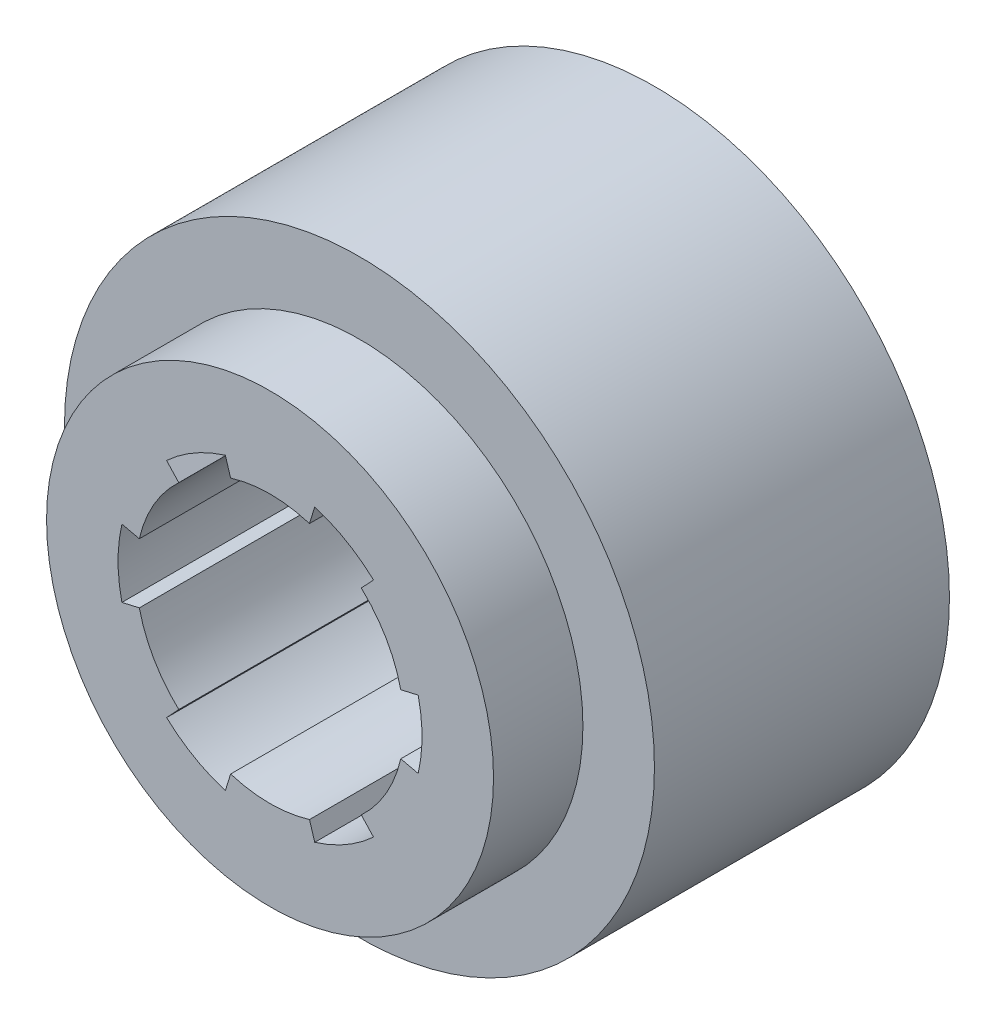
ISO-10303-21;
HEADER;
FILE_DESCRIPTION(('STEP AP214'),'2;1');
FILE_NAME('part.step','',(''),(''),'','','');
FILE_SCHEMA(('AUTOMOTIVE_DESIGN { 1 0 10303 214 1 1 1 1 }'));
ENDSEC;
DATA;
#1=APPLICATION_CONTEXT('core data for automotive mechanical design processes');
#2=APPLICATION_PROTOCOL_DEFINITION('international standard','automotive_design',2000,#1);
#3=PRODUCT_CONTEXT('',#1,'mechanical');
#4=PRODUCT('Part','Part','',(#3));
#5=PRODUCT_RELATED_PRODUCT_CATEGORY('part','',(#4));
#6=PRODUCT_DEFINITION_FORMATION('','',#4);
#7=PRODUCT_DEFINITION_CONTEXT('part definition',#1,'design');
#8=PRODUCT_DEFINITION('design','',#6,#7);
#9=PRODUCT_DEFINITION_SHAPE('','',#8);
#10=(LENGTH_UNIT() NAMED_UNIT(*) SI_UNIT(.MILLI.,.METRE.));
#11=(NAMED_UNIT(*) PLANE_ANGLE_UNIT() SI_UNIT($,.RADIAN.));
#12=(NAMED_UNIT(*) SI_UNIT($,.STERADIAN.) SOLID_ANGLE_UNIT());
#13=UNCERTAINTY_MEASURE_WITH_UNIT(LENGTH_MEASURE(1.E-05),#10,'distance_accuracy_value','');
#14=(GEOMETRIC_REPRESENTATION_CONTEXT(3) GLOBAL_UNCERTAINTY_ASSIGNED_CONTEXT((#13)) GLOBAL_UNIT_ASSIGNED_CONTEXT((#10,
#11,#12)) REPRESENTATION_CONTEXT('',''));
#15=CARTESIAN_POINT('',(0.,0.,0.));
#16=DIRECTION('',(0.,0.,1.));
#17=DIRECTION('',(1.,0.,0.));
#18=AXIS2_PLACEMENT_3D('',#15,#16,#17);
#19=CARTESIAN_POINT('',(0.,0.,5.));
#20=DIRECTION('',(0.,0.,1.));
#21=DIRECTION('',(1.,0.,0.));
#22=AXIS2_PLACEMENT_3D('',#19,#20,#21);
#23=PLANE('',#22);
#24=CARTESIAN_POINT('',(0.,0.,5.));
#25=DIRECTION('',(0.,0.,1.));
#26=DIRECTION('',(1.,0.,0.));
#27=AXIS2_PLACEMENT_3D('',#24,#25,#26);
#28=CIRCLE('',#27,25.);
#29=CARTESIAN_POINT('',(25.,0.,5.));
#30=VERTEX_POINT('',#29);
#31=EDGE_CURVE('E11',#30,#30,#28,.T.);
#32=ORIENTED_EDGE('',*,*,#31,.T.);
#33=EDGE_LOOP('',(#32));
#34=FACE_BOUND('',#33,.T.);
#35=DIRECTION('',(0.680661604674729,-0.73259796609165,0.));
#36=VECTOR('',#35,1.);
#37=CARTESIAN_POINT('',(-11.5712472794703,12.4541654235581,5.));
#38=LINE('',#37,#36);
#39=CARTESIAN_POINT('',(-11.5712472794703,12.4541654235581,5.));
#40=VERTEX_POINT('',#39);
#41=CARTESIAN_POINT('',(-10.2099240701208,10.9889694913748,5.));
#42=VERTEX_POINT('',#41);
#43=EDGE_CURVE('E292',#40,#42,#38,.T.);
#44=ORIENTED_EDGE('',*,*,#43,.F.);
#45=CARTESIAN_POINT('',(0.,0.,5.));
#46=DIRECTION('',(0.,0.,1.));
#47=DIRECTION('',(1.,0.,0.));
#48=AXIS2_PLACEMENT_3D('',#45,#46,#47);
#49=CIRCLE('',#48,17.);
#50=CARTESIAN_POINT('',(-5.,16.2480768092719,5.));
#51=VERTEX_POINT('',#50);
#52=EDGE_CURVE('E290',#51,#40,#49,.T.);
#53=ORIENTED_EDGE('',*,*,#52,.F.);
#54=DIRECTION('',(-0.294117647058829,0.955769224074817,0.));
#55=VECTOR('',#54,1.);
#56=CARTESIAN_POINT('',(-5.,16.2480768092719,5.));
#57=LINE('',#56,#55);
#58=CARTESIAN_POINT('',(-4.41176470588234,14.3365383611223,5.));
#59=VERTEX_POINT('',#58);
#60=EDGE_CURVE('E54',#59,#51,#57,.T.);
#61=ORIENTED_EDGE('',*,*,#60,.F.);
#62=CARTESIAN_POINT('',(0.,0.,5.));
#63=DIRECTION('',(0.,0.,1.));
#64=DIRECTION('',(1.,0.,0.));
#65=AXIS2_PLACEMENT_3D('',#62,#63,#64);
#66=CIRCLE('',#65,15.);
#67=CARTESIAN_POINT('',(4.41176470588237,14.3365383611223,5.));
#68=VERTEX_POINT('',#67);
#69=EDGE_CURVE('E333',#68,#59,#66,.T.);
#70=ORIENTED_EDGE('',*,*,#69,.F.);
#71=DIRECTION('',(-0.294117647058815,-0.955769224074822,0.));
#72=VECTOR('',#71,1.);
#73=CARTESIAN_POINT('',(5.,16.2480768092719,5.));
#74=LINE('',#73,#72);
#75=CARTESIAN_POINT('',(5.,16.2480768092719,5.));
#76=VERTEX_POINT('',#75);
#77=EDGE_CURVE('E331',#76,#68,#74,.T.);
#78=ORIENTED_EDGE('',*,*,#77,.F.);
#79=CARTESIAN_POINT('',(0.,0.,5.));
#80=DIRECTION('',(0.,0.,1.));
#81=DIRECTION('',(1.,0.,0.));
#82=AXIS2_PLACEMENT_3D('',#79,#80,#81);
#83=CIRCLE('',#82,17.);
#84=CARTESIAN_POINT('',(11.5712472794703,12.4541654235582,5.));
#85=VERTEX_POINT('',#84);
#86=EDGE_CURVE('E329',#85,#76,#83,.T.);
#87=ORIENTED_EDGE('',*,*,#86,.F.);
#88=DIRECTION('',(0.680661604674719,0.73259796609166,0.));
#89=VECTOR('',#88,1.);
#90=CARTESIAN_POINT('',(11.5712472794703,12.4541654235582,5.));
#91=LINE('',#90,#89);
#92=CARTESIAN_POINT('',(10.2099240701209,10.9889694913748,5.));
#93=VERTEX_POINT('',#92);
#94=EDGE_CURVE('E202',#93,#85,#91,.T.);
#95=ORIENTED_EDGE('',*,*,#94,.F.);
#96=CARTESIAN_POINT('',(0.,0.,5.));
#97=DIRECTION('',(0.,0.,1.));
#98=DIRECTION('',(1.,0.,0.));
#99=AXIS2_PLACEMENT_3D('',#96,#97,#98);
#100=CIRCLE('',#99,15.);
#101=CARTESIAN_POINT('',(14.6216887760032,3.34756886974743,5.));
#102=VERTEX_POINT('',#101);
#103=EDGE_CURVE('E326',#102,#93,#100,.T.);
#104=ORIENTED_EDGE('',*,*,#103,.F.);
#105=DIRECTION('',(-0.974779251733544,-0.223171257983171,0.));
#106=VECTOR('',#105,1.);
#107=CARTESIAN_POINT('',(16.5712472794703,3.79391138571377,5.));
#108=LINE('',#107,#106);
#109=CARTESIAN_POINT('',(16.5712472794703,3.79391138571377,5.));
#110=VERTEX_POINT('',#109);
#111=EDGE_CURVE('E324',#110,#102,#108,.T.);
#112=ORIENTED_EDGE('',*,*,#111,.F.);
#113=CARTESIAN_POINT('',(0.,0.,5.));
#114=DIRECTION('',(0.,0.,1.));
#115=DIRECTION('',(1.,0.,0.));
#116=AXIS2_PLACEMENT_3D('',#113,#114,#115);
#117=CIRCLE('',#116,17.);
#118=CARTESIAN_POINT('',(16.5712472794703,-3.79391138571377,5.));
#119=VERTEX_POINT('',#118);
#120=EDGE_CURVE('E322',#119,#110,#117,.T.);
#121=ORIENTED_EDGE('',*,*,#120,.F.);
#122=DIRECTION('',(0.974779251733548,-0.223171257983157,0.));
#123=VECTOR('',#122,1.);
#124=CARTESIAN_POINT('',(16.5712472794703,-3.79391138571376,5.));
#125=LINE('',#124,#123);
#126=CARTESIAN_POINT('',(14.6216887760032,-3.34756886974745,5.));
#127=VERTEX_POINT('',#126);
#128=EDGE_CURVE('E320',#127,#119,#125,.T.);
#129=ORIENTED_EDGE('',*,*,#128,.F.);
#130=CARTESIAN_POINT('',(0.,0.,5.));
#131=DIRECTION('',(0.,0.,1.));
#132=DIRECTION('',(1.,0.,0.));
#133=AXIS2_PLACEMENT_3D('',#130,#131,#132);
#134=CIRCLE('',#133,15.);
#135=CARTESIAN_POINT('',(10.2099240701208,-10.9889694913749,5.));
#136=VERTEX_POINT('',#135);
#137=EDGE_CURVE('E318',#136,#127,#134,.T.);
#138=ORIENTED_EDGE('',*,*,#137,.F.);
#139=DIRECTION('',(-0.68066160467473,0.732597966091649,0.));
#140=VECTOR('',#139,1.);
#141=CARTESIAN_POINT('',(11.5712472794703,-12.4541654235582,5.));
#142=LINE('',#141,#140);
#143=CARTESIAN_POINT('',(11.5712472794703,-12.4541654235582,5.));
#144=VERTEX_POINT('',#143);
#145=EDGE_CURVE('E316',#144,#136,#142,.T.);
#146=ORIENTED_EDGE('',*,*,#145,.F.);
#147=CARTESIAN_POINT('',(0.,0.,5.));
#148=DIRECTION('',(0.,0.,1.));
#149=DIRECTION('',(1.,0.,0.));
#150=AXIS2_PLACEMENT_3D('',#147,#148,#149);
#151=CIRCLE('',#150,17.);
#152=CARTESIAN_POINT('',(5.,-16.2480768092719,5.));
#153=VERTEX_POINT('',#152);
#154=EDGE_CURVE('E314',#153,#144,#151,.T.);
#155=ORIENTED_EDGE('',*,*,#154,.F.);
#156=DIRECTION('',(0.294117647058829,-0.955769224074817,0.));
#157=VECTOR('',#156,1.);
#158=CARTESIAN_POINT('',(5.,-16.2480768092719,5.));
#159=LINE('',#158,#157);
#160=CARTESIAN_POINT('',(4.41176470588234,-14.3365383611223,5.));
#161=VERTEX_POINT('',#160);
#162=EDGE_CURVE('E312',#161,#153,#159,.T.);
#163=ORIENTED_EDGE('',*,*,#162,.F.);
#164=CARTESIAN_POINT('',(0.,0.,5.));
#165=DIRECTION('',(0.,0.,1.));
#166=DIRECTION('',(1.,0.,0.));
#167=AXIS2_PLACEMENT_3D('',#164,#165,#166);
#168=CIRCLE('',#167,15.);
#169=CARTESIAN_POINT('',(-4.41176470588237,-14.3365383611223,5.));
#170=VERTEX_POINT('',#169);
#171=EDGE_CURVE('E310',#170,#161,#168,.T.);
#172=ORIENTED_EDGE('',*,*,#171,.F.);
#173=DIRECTION('',(0.294117647058815,0.955769224074822,0.));
#174=VECTOR('',#173,1.);
#175=CARTESIAN_POINT('',(-5.,-16.2480768092719,5.));
#176=LINE('',#175,#174);
#177=CARTESIAN_POINT('',(-5.,-16.2480768092719,5.));
#178=VERTEX_POINT('',#177);
#179=EDGE_CURVE('E308',#178,#170,#176,.T.);
#180=ORIENTED_EDGE('',*,*,#179,.F.);
#181=CARTESIAN_POINT('',(0.,0.,5.));
#182=DIRECTION('',(0.,0.,1.));
#183=DIRECTION('',(1.,0.,0.));
#184=AXIS2_PLACEMENT_3D('',#181,#182,#183);
#185=CIRCLE('',#184,17.);
#186=CARTESIAN_POINT('',(-11.5712472794703,-12.4541654235582,5.));
#187=VERTEX_POINT('',#186);
#188=EDGE_CURVE('E306',#187,#178,#185,.T.);
#189=ORIENTED_EDGE('',*,*,#188,.F.);
#190=DIRECTION('',(-0.680661604674719,-0.73259796609166,0.));
#191=VECTOR('',#190,1.);
#192=CARTESIAN_POINT('',(-11.5712472794703,-12.4541654235582,5.));
#193=LINE('',#192,#191);
#194=CARTESIAN_POINT('',(-10.2099240701208,-10.9889694913748,5.));
#195=VERTEX_POINT('',#194);
#196=EDGE_CURVE('E304',#195,#187,#193,.T.);
#197=ORIENTED_EDGE('',*,*,#196,.F.);
#198=CARTESIAN_POINT('',(0.,0.,5.));
#199=DIRECTION('',(0.,0.,1.));
#200=DIRECTION('',(1.,0.,0.));
#201=AXIS2_PLACEMENT_3D('',#198,#199,#200);
#202=CIRCLE('',#201,15.);
#203=CARTESIAN_POINT('',(-14.6216887760032,-3.34756886974743,5.));
#204=VERTEX_POINT('',#203);
#205=EDGE_CURVE('E302',#204,#195,#202,.T.);
#206=ORIENTED_EDGE('',*,*,#205,.F.);
#207=DIRECTION('',(0.974779251733544,0.223171257983172,0.));
#208=VECTOR('',#207,1.);
#209=CARTESIAN_POINT('',(-16.5712472794703,-3.79391138571378,5.));
#210=LINE('',#209,#208);
#211=CARTESIAN_POINT('',(-16.5712472794703,-3.79391138571378,5.));
#212=VERTEX_POINT('',#211);
#213=EDGE_CURVE('E300',#212,#204,#210,.T.);
#214=ORIENTED_EDGE('',*,*,#213,.F.);
#215=CARTESIAN_POINT('',(0.,0.,5.));
#216=DIRECTION('',(0.,0.,1.));
#217=DIRECTION('',(1.,0.,0.));
#218=AXIS2_PLACEMENT_3D('',#215,#216,#217);
#219=CIRCLE('',#218,17.);
#220=CARTESIAN_POINT('',(-16.5712472794703,3.79391138571375,5.));
#221=VERTEX_POINT('',#220);
#222=EDGE_CURVE('E298',#221,#212,#219,.T.);
#223=ORIENTED_EDGE('',*,*,#222,.F.);
#224=DIRECTION('',(-0.974779251733548,0.223171257983156,0.));
#225=VECTOR('',#224,1.);
#226=CARTESIAN_POINT('',(-16.5712472794703,3.79391138571375,5.));
#227=LINE('',#226,#225);
#228=CARTESIAN_POINT('',(-14.6216887760032,3.34756886974744,5.));
#229=VERTEX_POINT('',#228);
#230=EDGE_CURVE('E296',#229,#221,#227,.T.);
#231=ORIENTED_EDGE('',*,*,#230,.F.);
#232=CARTESIAN_POINT('',(0.,0.,5.));
#233=DIRECTION('',(0.,0.,1.));
#234=DIRECTION('',(1.,0.,0.));
#235=AXIS2_PLACEMENT_3D('',#232,#233,#234);
#236=CIRCLE('',#235,15.);
#237=EDGE_CURVE('E294',#42,#229,#236,.T.);
#238=ORIENTED_EDGE('',*,*,#237,.F.);
#239=EDGE_LOOP('',(#44,#53,#61,#70,#78,#87,#95,#104,#112,#121,#129,#138,#146,#155,#163,#172,
#180,#189,#197,#206,#214,#223,#231,#238));
#240=FACE_BOUND('',#239,.T.);
#241=ADVANCED_FACE('F33',(#34,#240),#23,.T.);
#242=CARTESIAN_POINT('',(0.,0.,5.));
#243=DIRECTION('',(0.,0.,-1.));
#244=DIRECTION('',(-1.,0.,0.));
#245=AXIS2_PLACEMENT_3D('',#242,#243,#244);
#246=CYLINDRICAL_SURFACE('',#245,25.);
#247=ORIENTED_EDGE('',*,*,#31,.F.);
#248=EDGE_LOOP('',(#247));
#249=FACE_BOUND('',#248,.T.);
#250=CARTESIAN_POINT('',(0.,0.,-5.));
#251=DIRECTION('',(0.,0.,1.));
#252=DIRECTION('',(1.,0.,0.));
#253=AXIS2_PLACEMENT_3D('',#250,#251,#252);
#254=CIRCLE('',#253,25.);
#255=CARTESIAN_POINT('',(25.,0.,-5.));
#256=VERTEX_POINT('',#255);
#257=EDGE_CURVE('E37',#256,#256,#254,.T.);
#258=ORIENTED_EDGE('',*,*,#257,.T.);
#259=EDGE_LOOP('',(#258));
#260=FACE_BOUND('',#259,.T.);
#261=ADVANCED_FACE('F35',(#249,#260),#246,.T.);
#262=CARTESIAN_POINT('',(0.,0.,5.));
#263=DIRECTION('',(0.,0.,-1.));
#264=DIRECTION('',(-1.,0.,0.));
#265=AXIS2_PLACEMENT_3D('',#262,#263,#264);
#266=CYLINDRICAL_SURFACE('',#265,17.);
#267=DIRECTION('',(0.,0.,-1.));
#268=VECTOR('',#267,1.);
#269=CARTESIAN_POINT('',(-11.5712472794703,12.4541654235581,5.));
#270=LINE('',#269,#268);
#271=CARTESIAN_POINT('',(-11.5712472794703,12.4541654235581,-38.));
#272=VERTEX_POINT('',#271);
#273=EDGE_CURVE('E42',#40,#272,#270,.T.);
#274=ORIENTED_EDGE('',*,*,#273,.T.);
#275=CARTESIAN_POINT('',(0.,0.,-38.));
#276=DIRECTION('',(0.,0.,-1.));
#277=DIRECTION('',(-1.,0.,0.));
#278=AXIS2_PLACEMENT_3D('',#275,#276,#277);
#279=CIRCLE('',#278,17.);
#280=CARTESIAN_POINT('',(-5.,16.2480768092719,-38.));
#281=VERTEX_POINT('',#280);
#282=EDGE_CURVE('E274',#272,#281,#279,.T.);
#283=ORIENTED_EDGE('',*,*,#282,.T.);
#284=DIRECTION('',(0.,0.,-1.));
#285=VECTOR('',#284,1.);
#286=CARTESIAN_POINT('',(-5.,16.2480768092719,5.));
#287=LINE('',#286,#285);
#288=EDGE_CURVE('E336',#51,#281,#287,.T.);
#289=ORIENTED_EDGE('',*,*,#288,.F.);
#290=ORIENTED_EDGE('',*,*,#52,.T.);
#291=EDGE_LOOP('',(#274,#283,#289,#290));
#292=FACE_BOUND('',#291,.T.);
#293=ADVANCED_FACE('F379',(#292),#266,.F.);
#294=CARTESIAN_POINT('',(-11.5712472794703,12.4541654235581,5.));
#295=DIRECTION('',(0.73259796609165,0.680661604674729,0.));
#296=DIRECTION('',(-0.680661604674729,0.73259796609165,0.));
#297=AXIS2_PLACEMENT_3D('',#294,#295,#296);
#298=PLANE('',#297);
#299=DIRECTION('',(0.,0.,-1.));
#300=VECTOR('',#299,1.);
#301=CARTESIAN_POINT('',(-10.2099240701208,10.9889694913748,5.));
#302=LINE('',#301,#300);
#303=CARTESIAN_POINT('',(-10.2099240701208,10.9889694913748,-38.));
#304=VERTEX_POINT('',#303);
#305=EDGE_CURVE('E375',#42,#304,#302,.T.);
#306=ORIENTED_EDGE('',*,*,#305,.T.);
#307=DIRECTION('',(-0.680661604674728,0.732597966091651,0.));
#308=VECTOR('',#307,1.);
#309=CARTESIAN_POINT('',(-11.5712472794703,12.4541654235581,-38.));
#310=LINE('',#309,#308);
#311=EDGE_CURVE('E271',#304,#272,#310,.T.);
#312=ORIENTED_EDGE('',*,*,#311,.T.);
#313=ORIENTED_EDGE('',*,*,#273,.F.);
#314=ORIENTED_EDGE('',*,*,#43,.T.);
#315=EDGE_LOOP('',(#306,#312,#313,#314));
#316=FACE_BOUND('',#315,.T.);
#317=ADVANCED_FACE('F386',(#316),#298,.T.);
#318=CARTESIAN_POINT('',(0.,0.,5.));
#319=DIRECTION('',(0.,0.,-1.));
#320=DIRECTION('',(-1.,0.,0.));
#321=AXIS2_PLACEMENT_3D('',#318,#319,#320);
#322=CYLINDRICAL_SURFACE('',#321,15.);
#323=DIRECTION('',(0.,0.,-1.));
#324=VECTOR('',#323,1.);
#325=CARTESIAN_POINT('',(-14.6216887760032,3.34756886974744,5.));
#326=LINE('',#325,#324);
#327=CARTESIAN_POINT('',(-14.6216887760032,3.34756886974744,-38.));
#328=VERTEX_POINT('',#327);
#329=EDGE_CURVE('E373',#229,#328,#326,.T.);
#330=ORIENTED_EDGE('',*,*,#329,.T.);
#331=CARTESIAN_POINT('',(0.,0.,-38.));
#332=DIRECTION('',(0.,0.,-1.));
#333=DIRECTION('',(-1.,0.,0.));
#334=AXIS2_PLACEMENT_3D('',#331,#332,#333);
#335=CIRCLE('',#334,15.);
#336=EDGE_CURVE('E268',#328,#304,#335,.T.);
#337=ORIENTED_EDGE('',*,*,#336,.T.);
#338=ORIENTED_EDGE('',*,*,#305,.F.);
#339=ORIENTED_EDGE('',*,*,#237,.T.);
#340=EDGE_LOOP('',(#330,#337,#338,#339));
#341=FACE_BOUND('',#340,.T.);
#342=ADVANCED_FACE('F396',(#341),#322,.F.);
#343=CARTESIAN_POINT('',(-16.5712472794703,3.79391138571375,5.));
#344=DIRECTION('',(-0.223171257983156,-0.974779251733548,0.));
#345=DIRECTION('',(0.974779251733548,-0.223171257983156,0.));
#346=AXIS2_PLACEMENT_3D('',#343,#344,#345);
#347=PLANE('',#346);
#348=DIRECTION('',(0.,0.,-1.));
#349=VECTOR('',#348,1.);
#350=CARTESIAN_POINT('',(-16.5712472794703,3.79391138571375,5.));
#351=LINE('',#350,#349);
#352=CARTESIAN_POINT('',(-16.5712472794703,3.79391138571375,-38.));
#353=VERTEX_POINT('',#352);
#354=EDGE_CURVE('E371',#221,#353,#351,.T.);
#355=ORIENTED_EDGE('',*,*,#354,.T.);
#356=DIRECTION('',(0.974779251733548,-0.223171257983155,0.));
#357=VECTOR('',#356,1.);
#358=CARTESIAN_POINT('',(-14.6216887760032,3.34756886974744,-38.));
#359=LINE('',#358,#357);
#360=EDGE_CURVE('E265',#353,#328,#359,.T.);
#361=ORIENTED_EDGE('',*,*,#360,.T.);
#362=ORIENTED_EDGE('',*,*,#329,.F.);
#363=ORIENTED_EDGE('',*,*,#230,.T.);
#364=EDGE_LOOP('',(#355,#361,#362,#363));
#365=FACE_BOUND('',#364,.T.);
#366=ADVANCED_FACE('F402',(#365),#347,.T.);
#367=CARTESIAN_POINT('',(0.,0.,5.));
#368=DIRECTION('',(0.,0.,-1.));
#369=DIRECTION('',(-1.,0.,0.));
#370=AXIS2_PLACEMENT_3D('',#367,#368,#369);
#371=CYLINDRICAL_SURFACE('',#370,17.);
#372=DIRECTION('',(0.,0.,-1.));
#373=VECTOR('',#372,1.);
#374=CARTESIAN_POINT('',(-16.5712472794703,-3.79391138571378,5.));
#375=LINE('',#374,#373);
#376=CARTESIAN_POINT('',(-16.5712472794703,-3.79391138571379,-38.));
#377=VERTEX_POINT('',#376);
#378=EDGE_CURVE('E369',#212,#377,#375,.T.);
#379=ORIENTED_EDGE('',*,*,#378,.T.);
#380=CARTESIAN_POINT('',(0.,0.,-38.));
#381=DIRECTION('',(0.,0.,-1.));
#382=DIRECTION('',(-1.,0.,0.));
#383=AXIS2_PLACEMENT_3D('',#380,#381,#382);
#384=CIRCLE('',#383,17.);
#385=EDGE_CURVE('E262',#377,#353,#384,.T.);
#386=ORIENTED_EDGE('',*,*,#385,.T.);
#387=ORIENTED_EDGE('',*,*,#354,.F.);
#388=ORIENTED_EDGE('',*,*,#222,.T.);
#389=EDGE_LOOP('',(#379,#386,#387,#388));
#390=FACE_BOUND('',#389,.T.);
#391=ADVANCED_FACE('F406',(#390),#371,.F.);
#392=CARTESIAN_POINT('',(-16.5712472794703,-3.79391138571378,5.));
#393=DIRECTION('',(-0.223171257983172,0.974779251733544,0.));
#394=DIRECTION('',(-0.974779251733544,-0.223171257983172,0.));
#395=AXIS2_PLACEMENT_3D('',#392,#393,#394);
#396=PLANE('',#395);
#397=DIRECTION('',(0.,0.,-1.));
#398=VECTOR('',#397,1.);
#399=CARTESIAN_POINT('',(-14.6216887760032,-3.34756886974743,5.));
#400=LINE('',#399,#398);
#401=CARTESIAN_POINT('',(-14.6216887760032,-3.34756886974743,-38.));
#402=VERTEX_POINT('',#401);
#403=EDGE_CURVE('E367',#204,#402,#400,.T.);
#404=ORIENTED_EDGE('',*,*,#403,.T.);
#405=DIRECTION('',(-0.974779251733544,-0.223171257983175,0.));
#406=VECTOR('',#405,1.);
#407=CARTESIAN_POINT('',(-16.5712472794703,-3.79391138571378,-38.));
#408=LINE('',#407,#406);
#409=EDGE_CURVE('E259',#402,#377,#408,.T.);
#410=ORIENTED_EDGE('',*,*,#409,.T.);
#411=ORIENTED_EDGE('',*,*,#378,.F.);
#412=ORIENTED_EDGE('',*,*,#213,.T.);
#413=EDGE_LOOP('',(#404,#410,#411,#412));
#414=FACE_BOUND('',#413,.T.);
#415=ADVANCED_FACE('F410',(#414),#396,.T.);
#416=CARTESIAN_POINT('',(0.,0.,5.));
#417=DIRECTION('',(0.,0.,-1.));
#418=DIRECTION('',(-1.,0.,0.));
#419=AXIS2_PLACEMENT_3D('',#416,#417,#418);
#420=CYLINDRICAL_SURFACE('',#419,15.);
#421=DIRECTION('',(0.,0.,-1.));
#422=VECTOR('',#421,1.);
#423=CARTESIAN_POINT('',(-10.2099240701208,-10.9889694913748,5.));
#424=LINE('',#423,#422);
#425=CARTESIAN_POINT('',(-10.2099240701208,-10.9889694913748,-38.));
#426=VERTEX_POINT('',#425);
#427=EDGE_CURVE('E365',#195,#426,#424,.T.);
#428=ORIENTED_EDGE('',*,*,#427,.T.);
#429=CARTESIAN_POINT('',(0.,0.,-38.));
#430=DIRECTION('',(0.,0.,-1.));
#431=DIRECTION('',(-1.,0.,0.));
#432=AXIS2_PLACEMENT_3D('',#429,#430,#431);
#433=CIRCLE('',#432,15.);
#434=EDGE_CURVE('E256',#426,#402,#433,.T.);
#435=ORIENTED_EDGE('',*,*,#434,.T.);
#436=ORIENTED_EDGE('',*,*,#403,.F.);
#437=ORIENTED_EDGE('',*,*,#205,.T.);
#438=EDGE_LOOP('',(#428,#435,#436,#437));
#439=FACE_BOUND('',#438,.T.);
#440=ADVANCED_FACE('F416',(#439),#420,.F.);
#441=CARTESIAN_POINT('',(-11.5712472794703,-12.4541654235582,5.));
#442=DIRECTION('',(0.73259796609166,-0.680661604674719,0.));
#443=DIRECTION('',(0.680661604674719,0.73259796609166,0.));
#444=AXIS2_PLACEMENT_3D('',#441,#442,#443);
#445=PLANE('',#444);
#446=DIRECTION('',(0.,0.,-1.));
#447=VECTOR('',#446,1.);
#448=CARTESIAN_POINT('',(-11.5712472794703,-12.4541654235582,5.));
#449=LINE('',#448,#447);
#450=CARTESIAN_POINT('',(-11.5712472794703,-12.4541654235582,-38.));
#451=VERTEX_POINT('',#450);
#452=EDGE_CURVE('E363',#187,#451,#449,.T.);
#453=ORIENTED_EDGE('',*,*,#452,.T.);
#454=DIRECTION('',(0.680661604674721,0.732597966091658,0.));
#455=VECTOR('',#454,1.);
#456=CARTESIAN_POINT('',(-10.2099240701208,-10.9889694913748,-38.));
#457=LINE('',#456,#455);
#458=EDGE_CURVE('E253',#451,#426,#457,.T.);
#459=ORIENTED_EDGE('',*,*,#458,.T.);
#460=ORIENTED_EDGE('',*,*,#427,.F.);
#461=ORIENTED_EDGE('',*,*,#196,.T.);
#462=EDGE_LOOP('',(#453,#459,#460,#461));
#463=FACE_BOUND('',#462,.T.);
#464=ADVANCED_FACE('F421',(#463),#445,.T.);
#465=CARTESIAN_POINT('',(0.,0.,5.));
#466=DIRECTION('',(0.,0.,-1.));
#467=DIRECTION('',(-1.,0.,0.));
#468=AXIS2_PLACEMENT_3D('',#465,#466,#467);
#469=CYLINDRICAL_SURFACE('',#468,17.);
#470=DIRECTION('',(0.,0.,-1.));
#471=VECTOR('',#470,1.);
#472=CARTESIAN_POINT('',(-5.,-16.2480768092719,5.));
#473=LINE('',#472,#471);
#474=CARTESIAN_POINT('',(-5.,-16.2480768092719,-38.));
#475=VERTEX_POINT('',#474);
#476=EDGE_CURVE('E361',#178,#475,#473,.T.);
#477=ORIENTED_EDGE('',*,*,#476,.T.);
#478=CARTESIAN_POINT('',(0.,0.,-38.));
#479=DIRECTION('',(0.,0.,-1.));
#480=DIRECTION('',(-1.,0.,0.));
#481=AXIS2_PLACEMENT_3D('',#478,#479,#480);
#482=CIRCLE('',#481,17.);
#483=EDGE_CURVE('E250',#475,#451,#482,.T.);
#484=ORIENTED_EDGE('',*,*,#483,.T.);
#485=ORIENTED_EDGE('',*,*,#452,.F.);
#486=ORIENTED_EDGE('',*,*,#188,.T.);
#487=EDGE_LOOP('',(#477,#484,#485,#486));
#488=FACE_BOUND('',#487,.T.);
#489=ADVANCED_FACE('F425',(#488),#469,.F.);
#490=CARTESIAN_POINT('',(-5.,-16.2480768092719,5.));
#491=DIRECTION('',(-0.955769224074822,0.294117647058815,0.));
#492=DIRECTION('',(-0.294117647058815,-0.955769224074822,0.));
#493=AXIS2_PLACEMENT_3D('',#490,#491,#492);
#494=PLANE('',#493);
#495=DIRECTION('',(0.,0.,-1.));
#496=VECTOR('',#495,1.);
#497=CARTESIAN_POINT('',(-4.41176470588237,-14.3365383611223,5.));
#498=LINE('',#497,#496);
#499=CARTESIAN_POINT('',(-4.41176470588237,-14.3365383611223,-38.));
#500=VERTEX_POINT('',#499);
#501=EDGE_CURVE('E359',#170,#500,#498,.T.);
#502=ORIENTED_EDGE('',*,*,#501,.T.);
#503=DIRECTION('',(-0.294117647058813,-0.955769224074822,0.));
#504=VECTOR('',#503,1.);
#505=CARTESIAN_POINT('',(-5.,-16.2480768092719,-38.));
#506=LINE('',#505,#504);
#507=EDGE_CURVE('E247',#500,#475,#506,.T.);
#508=ORIENTED_EDGE('',*,*,#507,.T.);
#509=ORIENTED_EDGE('',*,*,#476,.F.);
#510=ORIENTED_EDGE('',*,*,#179,.T.);
#511=EDGE_LOOP('',(#502,#508,#509,#510));
#512=FACE_BOUND('',#511,.T.);
#513=ADVANCED_FACE('F431',(#512),#494,.T.);
#514=CARTESIAN_POINT('',(0.,0.,5.));
#515=DIRECTION('',(0.,0.,-1.));
#516=DIRECTION('',(-1.,0.,0.));
#517=AXIS2_PLACEMENT_3D('',#514,#515,#516);
#518=CYLINDRICAL_SURFACE('',#517,15.);
#519=DIRECTION('',(0.,0.,-1.));
#520=VECTOR('',#519,1.);
#521=CARTESIAN_POINT('',(4.41176470588234,-14.3365383611223,5.));
#522=LINE('',#521,#520);
#523=CARTESIAN_POINT('',(4.41176470588235,-14.3365383611223,-38.));
#524=VERTEX_POINT('',#523);
#525=EDGE_CURVE('E357',#161,#524,#522,.T.);
#526=ORIENTED_EDGE('',*,*,#525,.T.);
#527=CARTESIAN_POINT('',(0.,0.,-38.));
#528=DIRECTION('',(0.,0.,-1.));
#529=DIRECTION('',(-1.,0.,0.));
#530=AXIS2_PLACEMENT_3D('',#527,#528,#529);
#531=CIRCLE('',#530,15.);
#532=EDGE_CURVE('E244',#524,#500,#531,.T.);
#533=ORIENTED_EDGE('',*,*,#532,.T.);
#534=ORIENTED_EDGE('',*,*,#501,.F.);
#535=ORIENTED_EDGE('',*,*,#171,.T.);
#536=EDGE_LOOP('',(#526,#533,#534,#535));
#537=FACE_BOUND('',#536,.T.);
#538=ADVANCED_FACE('F436',(#537),#518,.F.);
#539=CARTESIAN_POINT('',(5.,-16.2480768092719,5.));
#540=DIRECTION('',(0.955769224074817,0.294117647058829,0.));
#541=DIRECTION('',(-0.294117647058829,0.955769224074817,0.));
#542=AXIS2_PLACEMENT_3D('',#539,#540,#541);
#543=PLANE('',#542);
#544=DIRECTION('',(0.,0.,-1.));
#545=VECTOR('',#544,1.);
#546=CARTESIAN_POINT('',(5.,-16.2480768092719,5.));
#547=LINE('',#546,#545);
#548=CARTESIAN_POINT('',(5.,-16.2480768092719,-38.));
#549=VERTEX_POINT('',#548);
#550=EDGE_CURVE('E355',#153,#549,#547,.T.);
#551=ORIENTED_EDGE('',*,*,#550,.T.);
#552=DIRECTION('',(-0.29411764705883,0.955769224074817,0.));
#553=VECTOR('',#552,1.);
#554=CARTESIAN_POINT('',(4.41176470588234,-14.3365383611223,-38.));
#555=LINE('',#554,#553);
#556=EDGE_CURVE('E241',#549,#524,#555,.T.);
#557=ORIENTED_EDGE('',*,*,#556,.T.);
#558=ORIENTED_EDGE('',*,*,#525,.F.);
#559=ORIENTED_EDGE('',*,*,#162,.T.);
#560=EDGE_LOOP('',(#551,#557,#558,#559));
#561=FACE_BOUND('',#560,.T.);
#562=ADVANCED_FACE('F440',(#561),#543,.T.);
#563=CARTESIAN_POINT('',(0.,0.,5.));
#564=DIRECTION('',(0.,0.,-1.));
#565=DIRECTION('',(-1.,0.,0.));
#566=AXIS2_PLACEMENT_3D('',#563,#564,#565);
#567=CYLINDRICAL_SURFACE('',#566,17.);
#568=DIRECTION('',(0.,0.,-1.));
#569=VECTOR('',#568,1.);
#570=CARTESIAN_POINT('',(11.5712472794703,-12.4541654235582,5.));
#571=LINE('',#570,#569);
#572=CARTESIAN_POINT('',(11.5712472794703,-12.4541654235582,-38.));
#573=VERTEX_POINT('',#572);
#574=EDGE_CURVE('E353',#144,#573,#571,.T.);
#575=ORIENTED_EDGE('',*,*,#574,.T.);
#576=CARTESIAN_POINT('',(0.,0.,-38.));
#577=DIRECTION('',(0.,0.,-1.));
#578=DIRECTION('',(-1.,0.,0.));
#579=AXIS2_PLACEMENT_3D('',#576,#577,#578);
#580=CIRCLE('',#579,17.);
#581=EDGE_CURVE('E238',#573,#549,#580,.T.);
#582=ORIENTED_EDGE('',*,*,#581,.T.);
#583=ORIENTED_EDGE('',*,*,#550,.F.);
#584=ORIENTED_EDGE('',*,*,#154,.T.);
#585=EDGE_LOOP('',(#575,#582,#583,#584));
#586=FACE_BOUND('',#585,.T.);
#587=ADVANCED_FACE('F446',(#586),#567,.F.);
#588=CARTESIAN_POINT('',(11.5712472794703,-12.4541654235582,5.));
#589=DIRECTION('',(-0.732597966091649,-0.68066160467473,0.));
#590=DIRECTION('',(0.68066160467473,-0.732597966091649,0.));
#591=AXIS2_PLACEMENT_3D('',#588,#589,#590);
#592=PLANE('',#591);
#593=DIRECTION('',(0.,0.,-1.));
#594=VECTOR('',#593,1.);
#595=CARTESIAN_POINT('',(10.2099240701208,-10.9889694913749,5.));
#596=LINE('',#595,#594);
#597=CARTESIAN_POINT('',(10.2099240701208,-10.9889694913749,-38.));
#598=VERTEX_POINT('',#597);
#599=EDGE_CURVE('E351',#136,#598,#596,.T.);
#600=ORIENTED_EDGE('',*,*,#599,.T.);
#601=DIRECTION('',(0.680661604674734,-0.732597966091645,0.));
#602=VECTOR('',#601,1.);
#603=CARTESIAN_POINT('',(11.5712472794703,-12.4541654235582,-38.));
#604=LINE('',#603,#602);
#605=EDGE_CURVE('E235',#598,#573,#604,.T.);
#606=ORIENTED_EDGE('',*,*,#605,.T.);
#607=ORIENTED_EDGE('',*,*,#574,.F.);
#608=ORIENTED_EDGE('',*,*,#145,.T.);
#609=EDGE_LOOP('',(#600,#606,#607,#608));
#610=FACE_BOUND('',#609,.T.);
#611=ADVANCED_FACE('F451',(#610),#592,.T.);
#612=CARTESIAN_POINT('',(0.,0.,5.));
#613=DIRECTION('',(0.,0.,-1.));
#614=DIRECTION('',(-1.,0.,0.));
#615=AXIS2_PLACEMENT_3D('',#612,#613,#614);
#616=CYLINDRICAL_SURFACE('',#615,15.);
#617=DIRECTION('',(0.,0.,-1.));
#618=VECTOR('',#617,1.);
#619=CARTESIAN_POINT('',(14.6216887760032,-3.34756886974745,5.));
#620=LINE('',#619,#618);
#621=CARTESIAN_POINT('',(14.6216887760032,-3.34756886974745,-38.));
#622=VERTEX_POINT('',#621);
#623=EDGE_CURVE('E349',#127,#622,#620,.T.);
#624=ORIENTED_EDGE('',*,*,#623,.T.);
#625=CARTESIAN_POINT('',(0.,0.,-38.));
#626=DIRECTION('',(0.,0.,-1.));
#627=DIRECTION('',(-1.,0.,0.));
#628=AXIS2_PLACEMENT_3D('',#625,#626,#627);
#629=CIRCLE('',#628,15.);
#630=EDGE_CURVE('E232',#622,#598,#629,.T.);
#631=ORIENTED_EDGE('',*,*,#630,.T.);
#632=ORIENTED_EDGE('',*,*,#599,.F.);
#633=ORIENTED_EDGE('',*,*,#137,.T.);
#634=EDGE_LOOP('',(#624,#631,#632,#633));
#635=FACE_BOUND('',#634,.T.);
#636=ADVANCED_FACE('F455',(#635),#616,.F.);
#637=CARTESIAN_POINT('',(16.5712472794703,-3.79391138571376,5.));
#638=DIRECTION('',(0.223171257983157,0.974779251733548,0.));
#639=DIRECTION('',(-0.974779251733548,0.223171257983157,0.));
#640=AXIS2_PLACEMENT_3D('',#637,#638,#639);
#641=PLANE('',#640);
#642=DIRECTION('',(0.,0.,-1.));
#643=VECTOR('',#642,1.);
#644=CARTESIAN_POINT('',(16.5712472794703,-3.79391138571377,5.));
#645=LINE('',#644,#643);
#646=CARTESIAN_POINT('',(16.5712472794703,-3.79391138571377,-38.));
#647=VERTEX_POINT('',#646);
#648=EDGE_CURVE('E347',#119,#647,#645,.T.);
#649=ORIENTED_EDGE('',*,*,#648,.T.);
#650=DIRECTION('',(-0.974779251733547,0.22317125798316,0.));
#651=VECTOR('',#650,1.);
#652=CARTESIAN_POINT('',(14.6216887760032,-3.34756886974745,-38.));
#653=LINE('',#652,#651);
#654=EDGE_CURVE('E229',#647,#622,#653,.T.);
#655=ORIENTED_EDGE('',*,*,#654,.T.);
#656=ORIENTED_EDGE('',*,*,#623,.F.);
#657=ORIENTED_EDGE('',*,*,#128,.T.);
#658=EDGE_LOOP('',(#649,#655,#656,#657));
#659=FACE_BOUND('',#658,.T.);
#660=ADVANCED_FACE('F460',(#659),#641,.T.);
#661=CARTESIAN_POINT('',(0.,0.,5.));
#662=DIRECTION('',(0.,0.,-1.));
#663=DIRECTION('',(-1.,0.,0.));
#664=AXIS2_PLACEMENT_3D('',#661,#662,#663);
#665=CYLINDRICAL_SURFACE('',#664,17.);
#666=DIRECTION('',(0.,0.,-1.));
#667=VECTOR('',#666,1.);
#668=CARTESIAN_POINT('',(16.5712472794703,3.79391138571377,5.));
#669=LINE('',#668,#667);
#670=CARTESIAN_POINT('',(16.5712472794703,3.79391138571377,-38.));
#671=VERTEX_POINT('',#670);
#672=EDGE_CURVE('E345',#110,#671,#669,.T.);
#673=ORIENTED_EDGE('',*,*,#672,.T.);
#674=CARTESIAN_POINT('',(0.,0.,-38.));
#675=DIRECTION('',(0.,0.,-1.));
#676=DIRECTION('',(-1.,0.,0.));
#677=AXIS2_PLACEMENT_3D('',#674,#675,#676);
#678=CIRCLE('',#677,17.);
#679=EDGE_CURVE('E226',#671,#647,#678,.T.);
#680=ORIENTED_EDGE('',*,*,#679,.T.);
#681=ORIENTED_EDGE('',*,*,#648,.F.);
#682=ORIENTED_EDGE('',*,*,#120,.T.);
#683=EDGE_LOOP('',(#673,#680,#681,#682));
#684=FACE_BOUND('',#683,.T.);
#685=ADVANCED_FACE('F465',(#684),#665,.F.);
#686=CARTESIAN_POINT('',(16.5712472794703,3.79391138571377,5.));
#687=DIRECTION('',(0.223171257983171,-0.974779251733545,0.));
#688=DIRECTION('',(0.974779251733545,0.223171257983171,0.));
#689=AXIS2_PLACEMENT_3D('',#686,#687,#688);
#690=PLANE('',#689);
#691=DIRECTION('',(0.,0.,-1.));
#692=VECTOR('',#691,1.);
#693=CARTESIAN_POINT('',(14.6216887760032,3.34756886974743,5.));
#694=LINE('',#693,#692);
#695=CARTESIAN_POINT('',(14.6216887760032,3.34756886974743,-38.));
#696=VERTEX_POINT('',#695);
#697=EDGE_CURVE('E343',#102,#696,#694,.T.);
#698=ORIENTED_EDGE('',*,*,#697,.T.);
#699=DIRECTION('',(0.974779251733545,0.223171257983171,0.));
#700=VECTOR('',#699,1.);
#701=CARTESIAN_POINT('',(16.5712472794703,3.79391138571377,-38.));
#702=LINE('',#701,#700);
#703=EDGE_CURVE('E221',#696,#671,#702,.T.);
#704=ORIENTED_EDGE('',*,*,#703,.T.);
#705=ORIENTED_EDGE('',*,*,#672,.F.);
#706=ORIENTED_EDGE('',*,*,#111,.T.);
#707=EDGE_LOOP('',(#698,#704,#705,#706));
#708=FACE_BOUND('',#707,.T.);
#709=ADVANCED_FACE('F469',(#708),#690,.T.);
#710=CARTESIAN_POINT('',(0.,0.,5.));
#711=DIRECTION('',(0.,0.,-1.));
#712=DIRECTION('',(-1.,0.,0.));
#713=AXIS2_PLACEMENT_3D('',#710,#711,#712);
#714=CYLINDRICAL_SURFACE('',#713,15.);
#715=DIRECTION('',(0.,0.,-1.));
#716=VECTOR('',#715,1.);
#717=CARTESIAN_POINT('',(10.2099240701209,10.9889694913748,5.));
#718=LINE('',#717,#716);
#719=CARTESIAN_POINT('',(10.2099240701209,10.9889694913748,-38.));
#720=VERTEX_POINT('',#719);
#721=EDGE_CURVE('E205',#93,#720,#718,.T.);
#722=ORIENTED_EDGE('',*,*,#721,.T.);
#723=CARTESIAN_POINT('',(0.,0.,-38.));
#724=DIRECTION('',(0.,0.,-1.));
#725=DIRECTION('',(-1.,0.,0.));
#726=AXIS2_PLACEMENT_3D('',#723,#724,#725);
#727=CIRCLE('',#726,15.);
#728=EDGE_CURVE('E219',#720,#696,#727,.T.);
#729=ORIENTED_EDGE('',*,*,#728,.T.);
#730=ORIENTED_EDGE('',*,*,#697,.F.);
#731=ORIENTED_EDGE('',*,*,#103,.T.);
#732=EDGE_LOOP('',(#722,#729,#730,#731));
#733=FACE_BOUND('',#732,.T.);
#734=ADVANCED_FACE('F473',(#733),#714,.F.);
#735=CARTESIAN_POINT('',(11.5712472794703,12.4541654235582,5.));
#736=DIRECTION('',(-0.73259796609166,0.680661604674719,0.));
#737=DIRECTION('',(-0.680661604674719,-0.73259796609166,0.));
#738=AXIS2_PLACEMENT_3D('',#735,#736,#737);
#739=PLANE('',#738);
#740=DIRECTION('',(0.,0.,-1.));
#741=VECTOR('',#740,1.);
#742=CARTESIAN_POINT('',(11.5712472794703,12.4541654235582,5.));
#743=LINE('',#742,#741);
#744=CARTESIAN_POINT('',(11.5712472794703,12.4541654235582,-38.));
#745=VERTEX_POINT('',#744);
#746=EDGE_CURVE('E194',#85,#745,#743,.T.);
#747=ORIENTED_EDGE('',*,*,#746,.T.);
#748=DIRECTION('',(-0.68066160467472,-0.732597966091659,0.));
#749=VECTOR('',#748,1.);
#750=CARTESIAN_POINT('',(10.2099240701209,10.9889694913748,-38.));
#751=LINE('',#750,#749);
#752=EDGE_CURVE('E199',#745,#720,#751,.T.);
#753=ORIENTED_EDGE('',*,*,#752,.T.);
#754=ORIENTED_EDGE('',*,*,#721,.F.);
#755=ORIENTED_EDGE('',*,*,#94,.T.);
#756=EDGE_LOOP('',(#747,#753,#754,#755));
#757=FACE_BOUND('',#756,.T.);
#758=ADVANCED_FACE('F196',(#757),#739,.T.);
#759=CARTESIAN_POINT('',(0.,0.,5.));
#760=DIRECTION('',(0.,0.,-1.));
#761=DIRECTION('',(-1.,0.,0.));
#762=AXIS2_PLACEMENT_3D('',#759,#760,#761);
#763=CYLINDRICAL_SURFACE('',#762,17.);
#764=DIRECTION('',(0.,0.,-1.));
#765=VECTOR('',#764,1.);
#766=CARTESIAN_POINT('',(5.,16.2480768092719,5.));
#767=LINE('',#766,#765);
#768=CARTESIAN_POINT('',(5.,16.2480768092719,-38.));
#769=VERTEX_POINT('',#768);
#770=EDGE_CURVE('E206',#76,#769,#767,.T.);
#771=ORIENTED_EDGE('',*,*,#770,.T.);
#772=CARTESIAN_POINT('',(0.,0.,-38.));
#773=DIRECTION('',(0.,0.,-1.));
#774=DIRECTION('',(-1.,0.,0.));
#775=AXIS2_PLACEMENT_3D('',#772,#773,#774);
#776=CIRCLE('',#775,17.);
#777=EDGE_CURVE('E209',#769,#745,#776,.T.);
#778=ORIENTED_EDGE('',*,*,#777,.T.);
#779=ORIENTED_EDGE('',*,*,#746,.F.);
#780=ORIENTED_EDGE('',*,*,#86,.T.);
#781=EDGE_LOOP('',(#771,#778,#779,#780));
#782=FACE_BOUND('',#781,.T.);
#783=ADVANCED_FACE('F210',(#782),#763,.F.);
#784=CARTESIAN_POINT('',(5.,16.2480768092719,5.));
#785=DIRECTION('',(0.955769224074822,-0.294117647058815,0.));
#786=DIRECTION('',(0.294117647058815,0.955769224074822,0.));
#787=AXIS2_PLACEMENT_3D('',#784,#785,#786);
#788=PLANE('',#787);
#789=DIRECTION('',(0.,0.,-1.));
#790=VECTOR('',#789,1.);
#791=CARTESIAN_POINT('',(4.41176470588237,14.3365383611223,5.));
#792=LINE('',#791,#790);
#793=CARTESIAN_POINT('',(4.41176470588237,14.3365383611223,-38.));
#794=VERTEX_POINT('',#793);
#795=EDGE_CURVE('E339',#68,#794,#792,.T.);
#796=ORIENTED_EDGE('',*,*,#795,.T.);
#797=DIRECTION('',(0.294117647058814,0.955769224074822,0.));
#798=VECTOR('',#797,1.);
#799=CARTESIAN_POINT('',(5.,16.2480768092719,-38.));
#800=LINE('',#799,#798);
#801=EDGE_CURVE('E282',#794,#769,#800,.T.);
#802=ORIENTED_EDGE('',*,*,#801,.T.);
#803=ORIENTED_EDGE('',*,*,#770,.F.);
#804=ORIENTED_EDGE('',*,*,#77,.T.);
#805=EDGE_LOOP('',(#796,#802,#803,#804));
#806=FACE_BOUND('',#805,.T.);
#807=ADVANCED_FACE('F476',(#806),#788,.T.);
#808=CARTESIAN_POINT('',(0.,0.,5.));
#809=DIRECTION('',(0.,0.,-1.));
#810=DIRECTION('',(-1.,0.,0.));
#811=AXIS2_PLACEMENT_3D('',#808,#809,#810);
#812=CYLINDRICAL_SURFACE('',#811,15.);
#813=DIRECTION('',(0.,0.,-1.));
#814=VECTOR('',#813,1.);
#815=CARTESIAN_POINT('',(-4.41176470588234,14.3365383611223,5.));
#816=LINE('',#815,#814);
#817=CARTESIAN_POINT('',(-4.41176470588234,14.3365383611223,-38.));
#818=VERTEX_POINT('',#817);
#819=EDGE_CURVE('E49',#59,#818,#816,.T.);
#820=ORIENTED_EDGE('',*,*,#819,.T.);
#821=CARTESIAN_POINT('',(0.,0.,-38.));
#822=DIRECTION('',(0.,0.,-1.));
#823=DIRECTION('',(-1.,0.,0.));
#824=AXIS2_PLACEMENT_3D('',#821,#822,#823);
#825=CIRCLE('',#824,15.);
#826=EDGE_CURVE('E279',#818,#794,#825,.T.);
#827=ORIENTED_EDGE('',*,*,#826,.T.);
#828=ORIENTED_EDGE('',*,*,#795,.F.);
#829=ORIENTED_EDGE('',*,*,#69,.T.);
#830=EDGE_LOOP('',(#820,#827,#828,#829));
#831=FACE_BOUND('',#830,.T.);
#832=ADVANCED_FACE('F479',(#831),#812,.F.);
#833=CARTESIAN_POINT('',(-5.,16.2480768092719,5.));
#834=DIRECTION('',(-0.955769224074817,-0.294117647058829,0.));
#835=DIRECTION('',(0.294117647058829,-0.955769224074817,0.));
#836=AXIS2_PLACEMENT_3D('',#833,#834,#835);
#837=PLANE('',#836);
#838=ORIENTED_EDGE('',*,*,#288,.T.);
#839=DIRECTION('',(0.294117647058829,-0.955769224074817,0.));
#840=VECTOR('',#839,1.);
#841=CARTESIAN_POINT('',(-4.41176470588234,14.3365383611223,-38.));
#842=LINE('',#841,#840);
#843=EDGE_CURVE('E277',#281,#818,#842,.T.);
#844=ORIENTED_EDGE('',*,*,#843,.T.);
#845=ORIENTED_EDGE('',*,*,#819,.F.);
#846=ORIENTED_EDGE('',*,*,#60,.T.);
#847=EDGE_LOOP('',(#838,#844,#845,#846));
#848=FACE_BOUND('',#847,.T.);
#849=ADVANCED_FACE('F390',(#848),#837,.T.);
#850=CARTESIAN_POINT('',(0.,0.,-38.));
#851=DIRECTION('',(0.,0.,-1.));
#852=DIRECTION('',(-1.,0.,0.));
#853=AXIS2_PLACEMENT_3D('',#850,#851,#852);
#854=PLANE('',#853);
#855=CARTESIAN_POINT('',(0.,0.,-38.));
#856=DIRECTION('',(0.,0.,-1.));
#857=DIRECTION('',(-1.,0.,0.));
#858=AXIS2_PLACEMENT_3D('',#855,#856,#857);
#859=CIRCLE('',#858,33.);
#860=CARTESIAN_POINT('',(-33.,0.,-38.));
#861=VERTEX_POINT('',#860);
#862=EDGE_CURVE('E285',#861,#861,#859,.T.);
#863=ORIENTED_EDGE('',*,*,#862,.T.);
#864=EDGE_LOOP('',(#863));
#865=FACE_BOUND('',#864,.T.);
#866=ORIENTED_EDGE('',*,*,#752,.F.);
#867=ORIENTED_EDGE('',*,*,#777,.F.);
#868=ORIENTED_EDGE('',*,*,#801,.F.);
#869=ORIENTED_EDGE('',*,*,#826,.F.);
#870=ORIENTED_EDGE('',*,*,#843,.F.);
#871=ORIENTED_EDGE('',*,*,#282,.F.);
#872=ORIENTED_EDGE('',*,*,#311,.F.);
#873=ORIENTED_EDGE('',*,*,#336,.F.);
#874=ORIENTED_EDGE('',*,*,#360,.F.);
#875=ORIENTED_EDGE('',*,*,#385,.F.);
#876=ORIENTED_EDGE('',*,*,#409,.F.);
#877=ORIENTED_EDGE('',*,*,#434,.F.);
#878=ORIENTED_EDGE('',*,*,#458,.F.);
#879=ORIENTED_EDGE('',*,*,#483,.F.);
#880=ORIENTED_EDGE('',*,*,#507,.F.);
#881=ORIENTED_EDGE('',*,*,#532,.F.);
#882=ORIENTED_EDGE('',*,*,#556,.F.);
#883=ORIENTED_EDGE('',*,*,#581,.F.);
#884=ORIENTED_EDGE('',*,*,#605,.F.);
#885=ORIENTED_EDGE('',*,*,#630,.F.);
#886=ORIENTED_EDGE('',*,*,#654,.F.);
#887=ORIENTED_EDGE('',*,*,#679,.F.);
#888=ORIENTED_EDGE('',*,*,#703,.F.);
#889=ORIENTED_EDGE('',*,*,#728,.F.);
#890=EDGE_LOOP('',(#866,#867,#868,#869,#870,#871,#872,#873,#874,#875,#876,#877,#878,#879,#880,
#881,#882,#883,#884,#885,#886,#887,#888,#889));
#891=FACE_BOUND('',#890,.T.);
#892=ADVANCED_FACE('F216',(#865,#891),#854,.T.);
#893=CARTESIAN_POINT('',(0.,0.,-5.));
#894=DIRECTION('',(0.,0.,-1.));
#895=DIRECTION('',(-1.,0.,0.));
#896=AXIS2_PLACEMENT_3D('',#893,#894,#895);
#897=PLANE('',#896);
#898=ORIENTED_EDGE('',*,*,#257,.F.);
#899=EDGE_LOOP('',(#898));
#900=FACE_BOUND('',#899,.T.);
#901=CARTESIAN_POINT('',(0.,0.,-5.));
#902=DIRECTION('',(0.,0.,-1.));
#903=DIRECTION('',(-1.,0.,0.));
#904=AXIS2_PLACEMENT_3D('',#901,#902,#903);
#905=CIRCLE('',#904,33.);
#906=CARTESIAN_POINT('',(-33.,0.,-5.));
#907=VERTEX_POINT('',#906);
#908=EDGE_CURVE('E284',#907,#907,#905,.T.);
#909=ORIENTED_EDGE('',*,*,#908,.F.);
#910=EDGE_LOOP('',(#909));
#911=FACE_BOUND('',#910,.T.);
#912=ADVANCED_FACE('F566',(#900,#911),#897,.F.);
#913=CARTESIAN_POINT('',(0.,0.,-38.));
#914=DIRECTION('',(0.,0.,1.));
#915=DIRECTION('',(1.,0.,0.));
#916=AXIS2_PLACEMENT_3D('',#913,#914,#915);
#917=CYLINDRICAL_SURFACE('',#916,33.);
#918=ORIENTED_EDGE('',*,*,#862,.F.);
#919=EDGE_LOOP('',(#918));
#920=FACE_BOUND('',#919,.T.);
#921=ORIENTED_EDGE('',*,*,#908,.T.);
#922=EDGE_LOOP('',(#921));
#923=FACE_BOUND('',#922,.T.);
#924=ADVANCED_FACE('F576',(#920,#923),#917,.T.);
#925=CLOSED_SHELL('',(#241,#261,#293,#317,#342,#366,#391,#415,#440,#464,#489,#513,#538,#562,
#587,#611,#636,#660,#685,#709,#734,#758,#783,#807,#832,#849,#892,#912,#924));
#926=MANIFOLD_SOLID_BREP('B2',#925);
#927=ADVANCED_BREP_SHAPE_REPRESENTATION('',(#18,#926),#14);
#928=SHAPE_DEFINITION_REPRESENTATION(#9,#927);
ENDSEC;
END-ISO-10303-21;
